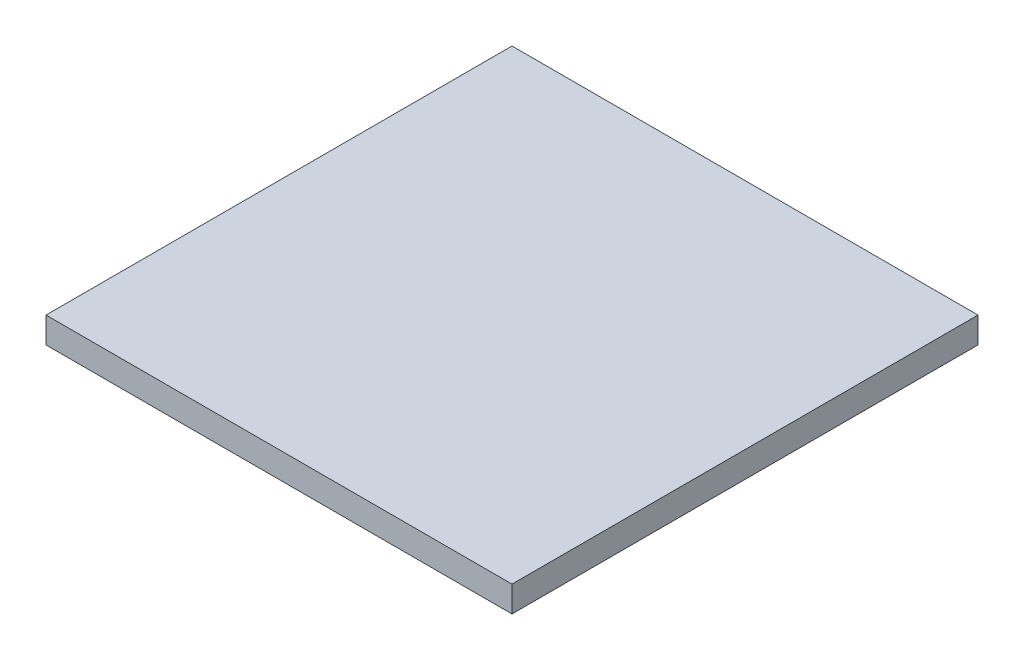
ISO-10303-21;
HEADER;
FILE_DESCRIPTION(('STEP AP214'),'2;1');
FILE_NAME('part.step','',(''),(''),'','','');
FILE_SCHEMA(('AUTOMOTIVE_DESIGN { 1 0 10303 214 1 1 1 1 }'));
ENDSEC;
DATA;
#1=APPLICATION_CONTEXT('core data for automotive mechanical design processes');
#2=APPLICATION_PROTOCOL_DEFINITION('international standard','automotive_design',2000,#1);
#3=PRODUCT_CONTEXT('',#1,'mechanical');
#4=PRODUCT('Part','Part','',(#3));
#5=PRODUCT_RELATED_PRODUCT_CATEGORY('part','',(#4));
#6=PRODUCT_DEFINITION_FORMATION('','',#4);
#7=PRODUCT_DEFINITION_CONTEXT('part definition',#1,'design');
#8=PRODUCT_DEFINITION('design','',#6,#7);
#9=PRODUCT_DEFINITION_SHAPE('','',#8);
#10=(LENGTH_UNIT() NAMED_UNIT(*) SI_UNIT(.MILLI.,.METRE.));
#11=(NAMED_UNIT(*) PLANE_ANGLE_UNIT() SI_UNIT($,.RADIAN.));
#12=(NAMED_UNIT(*) SI_UNIT($,.STERADIAN.) SOLID_ANGLE_UNIT());
#13=UNCERTAINTY_MEASURE_WITH_UNIT(LENGTH_MEASURE(1.E-05),#10,'distance_accuracy_value','');
#14=(GEOMETRIC_REPRESENTATION_CONTEXT(3) GLOBAL_UNCERTAINTY_ASSIGNED_CONTEXT((#13)) GLOBAL_UNIT_ASSIGNED_CONTEXT((#10,
#11,#12)) REPRESENTATION_CONTEXT('',''));
#15=CARTESIAN_POINT('',(0.,0.,0.));
#16=DIRECTION('',(0.,0.,1.));
#17=DIRECTION('',(1.,0.,0.));
#18=AXIS2_PLACEMENT_3D('',#15,#16,#17);
#19=CARTESIAN_POINT('',(-3.15,0.35,-3.15));
#20=DIRECTION('',(1.,0.,0.));
#21=DIRECTION('',(0.,0.,-1.));
#22=AXIS2_PLACEMENT_3D('',#19,#20,#21);
#23=PLANE('',#22);
#24=DIRECTION('',(0.,0.,1.));
#25=VECTOR('',#24,1.);
#26=CARTESIAN_POINT('',(-3.15,0.,-3.15));
#27=LINE('',#26,#25);
#28=CARTESIAN_POINT('',(-3.15,0.,-3.15));
#29=VERTEX_POINT('',#28);
#30=CARTESIAN_POINT('',(-3.15,0.,3.15));
#31=VERTEX_POINT('',#30);
#32=EDGE_CURVE('E95',#29,#31,#27,.T.);
#33=ORIENTED_EDGE('',*,*,#32,.T.);
#34=DIRECTION('',(0.,-1.,0.));
#35=VECTOR('',#34,1.);
#36=CARTESIAN_POINT('',(-3.15,0.35,3.15));
#37=LINE('',#36,#35);
#38=CARTESIAN_POINT('',(-3.15,0.35,3.15));
#39=VERTEX_POINT('',#38);
#40=EDGE_CURVE('E11',#39,#31,#37,.T.);
#41=ORIENTED_EDGE('',*,*,#40,.F.);
#42=DIRECTION('',(0.,0.,1.));
#43=VECTOR('',#42,1.);
#44=CARTESIAN_POINT('',(-3.15,0.35,-3.15));
#45=LINE('',#44,#43);
#46=CARTESIAN_POINT('',(-3.15,0.35,-3.15));
#47=VERTEX_POINT('',#46);
#48=EDGE_CURVE('E83',#47,#39,#45,.T.);
#49=ORIENTED_EDGE('',*,*,#48,.F.);
#50=DIRECTION('',(0.,-1.,0.));
#51=VECTOR('',#50,1.);
#52=CARTESIAN_POINT('',(-3.15,0.35,-3.15));
#53=LINE('',#52,#51);
#54=EDGE_CURVE('E91',#47,#29,#53,.T.);
#55=ORIENTED_EDGE('',*,*,#54,.T.);
#56=EDGE_LOOP('',(#33,#41,#49,#55));
#57=FACE_BOUND('',#56,.T.);
#58=ADVANCED_FACE('F32',(#57),#23,.F.);
#59=CARTESIAN_POINT('',(-3.15,0.35,3.15));
#60=DIRECTION('',(0.,0.,-1.));
#61=DIRECTION('',(-1.,0.,0.));
#62=AXIS2_PLACEMENT_3D('',#59,#60,#61);
#63=PLANE('',#62);
#64=DIRECTION('',(1.,0.,0.));
#65=VECTOR('',#64,1.);
#66=CARTESIAN_POINT('',(-3.15,0.,3.15));
#67=LINE('',#66,#65);
#68=CARTESIAN_POINT('',(3.15,0.,3.15));
#69=VERTEX_POINT('',#68);
#70=EDGE_CURVE('E87',#31,#69,#67,.T.);
#71=ORIENTED_EDGE('',*,*,#70,.T.);
#72=DIRECTION('',(0.,-1.,0.));
#73=VECTOR('',#72,1.);
#74=CARTESIAN_POINT('',(3.15,0.35,3.15));
#75=LINE('',#74,#73);
#76=CARTESIAN_POINT('',(3.15,0.35,3.15));
#77=VERTEX_POINT('',#76);
#78=EDGE_CURVE('E40',#77,#69,#75,.T.);
#79=ORIENTED_EDGE('',*,*,#78,.F.);
#80=DIRECTION('',(1.,0.,0.));
#81=VECTOR('',#80,1.);
#82=CARTESIAN_POINT('',(-3.15,0.35,3.15));
#83=LINE('',#82,#81);
#84=EDGE_CURVE('E78',#39,#77,#83,.T.);
#85=ORIENTED_EDGE('',*,*,#84,.F.);
#86=ORIENTED_EDGE('',*,*,#40,.T.);
#87=EDGE_LOOP('',(#71,#79,#85,#86));
#88=FACE_BOUND('',#87,.T.);
#89=ADVANCED_FACE('F86',(#88),#63,.F.);
#90=CARTESIAN_POINT('',(3.15,0.35,-3.15));
#91=DIRECTION('',(-1.,0.,0.));
#92=DIRECTION('',(0.,0.,1.));
#93=AXIS2_PLACEMENT_3D('',#90,#91,#92);
#94=PLANE('',#93);
#95=DIRECTION('',(0.,0.,-1.));
#96=VECTOR('',#95,1.);
#97=CARTESIAN_POINT('',(3.15,0.,-3.15));
#98=LINE('',#97,#96);
#99=CARTESIAN_POINT('',(3.15,0.,-3.15));
#100=VERTEX_POINT('',#99);
#101=EDGE_CURVE('E65',#69,#100,#98,.T.);
#102=ORIENTED_EDGE('',*,*,#101,.T.);
#103=DIRECTION('',(0.,-1.,0.));
#104=VECTOR('',#103,1.);
#105=CARTESIAN_POINT('',(3.15,0.35,-3.15));
#106=LINE('',#105,#104);
#107=CARTESIAN_POINT('',(3.15,0.35,-3.15));
#108=VERTEX_POINT('',#107);
#109=EDGE_CURVE('E88',#108,#100,#106,.T.);
#110=ORIENTED_EDGE('',*,*,#109,.F.);
#111=DIRECTION('',(0.,0.,-1.));
#112=VECTOR('',#111,1.);
#113=CARTESIAN_POINT('',(3.15,0.35,-3.15));
#114=LINE('',#113,#112);
#115=EDGE_CURVE('E81',#77,#108,#114,.T.);
#116=ORIENTED_EDGE('',*,*,#115,.F.);
#117=ORIENTED_EDGE('',*,*,#78,.T.);
#118=EDGE_LOOP('',(#102,#110,#116,#117));
#119=FACE_BOUND('',#118,.T.);
#120=ADVANCED_FACE('F89',(#119),#94,.F.);
#121=CARTESIAN_POINT('',(-3.15,0.35,-3.15));
#122=DIRECTION('',(0.,0.,1.));
#123=DIRECTION('',(1.,0.,0.));
#124=AXIS2_PLACEMENT_3D('',#121,#122,#123);
#125=PLANE('',#124);
#126=DIRECTION('',(-1.,0.,0.));
#127=VECTOR('',#126,1.);
#128=CARTESIAN_POINT('',(-3.15,0.,-3.15));
#129=LINE('',#128,#127);
#130=EDGE_CURVE('E71',#100,#29,#129,.T.);
#131=ORIENTED_EDGE('',*,*,#130,.T.);
#132=ORIENTED_EDGE('',*,*,#54,.F.);
#133=DIRECTION('',(-1.,0.,0.));
#134=VECTOR('',#133,1.);
#135=CARTESIAN_POINT('',(-3.15,0.35,-3.15));
#136=LINE('',#135,#134);
#137=EDGE_CURVE('E48',#108,#47,#136,.T.);
#138=ORIENTED_EDGE('',*,*,#137,.F.);
#139=ORIENTED_EDGE('',*,*,#109,.T.);
#140=EDGE_LOOP('',(#131,#132,#138,#139));
#141=FACE_BOUND('',#140,.T.);
#142=ADVANCED_FACE('F102',(#141),#125,.F.);
#143=CARTESIAN_POINT('',(0.,0.35,0.));
#144=DIRECTION('',(0.,1.,0.));
#145=DIRECTION('',(0.,0.,1.));
#146=AXIS2_PLACEMENT_3D('',#143,#144,#145);
#147=PLANE('',#146);
#148=ORIENTED_EDGE('',*,*,#48,.T.);
#149=ORIENTED_EDGE('',*,*,#84,.T.);
#150=ORIENTED_EDGE('',*,*,#115,.T.);
#151=ORIENTED_EDGE('',*,*,#137,.T.);
#152=EDGE_LOOP('',(#148,#149,#150,#151));
#153=FACE_BOUND('',#152,.T.);
#154=ADVANCED_FACE('F79',(#153),#147,.T.);
#155=CARTESIAN_POINT('',(0.,0.,0.));
#156=DIRECTION('',(0.,1.,0.));
#157=DIRECTION('',(0.,0.,1.));
#158=AXIS2_PLACEMENT_3D('',#155,#156,#157);
#159=PLANE('',#158);
#160=ORIENTED_EDGE('',*,*,#32,.F.);
#161=ORIENTED_EDGE('',*,*,#130,.F.);
#162=ORIENTED_EDGE('',*,*,#101,.F.);
#163=ORIENTED_EDGE('',*,*,#70,.F.);
#164=EDGE_LOOP('',(#160,#161,#162,#163));
#165=FACE_BOUND('',#164,.T.);
#166=ADVANCED_FACE('F105',(#165),#159,.F.);
#167=CLOSED_SHELL('',(#58,#89,#120,#142,#154,#166));
#168=MANIFOLD_SOLID_BREP('B2',#167);
#169=ADVANCED_BREP_SHAPE_REPRESENTATION('',(#18,#168),#14);
#170=SHAPE_DEFINITION_REPRESENTATION(#9,#169);
ENDSEC;
END-ISO-10303-21;
